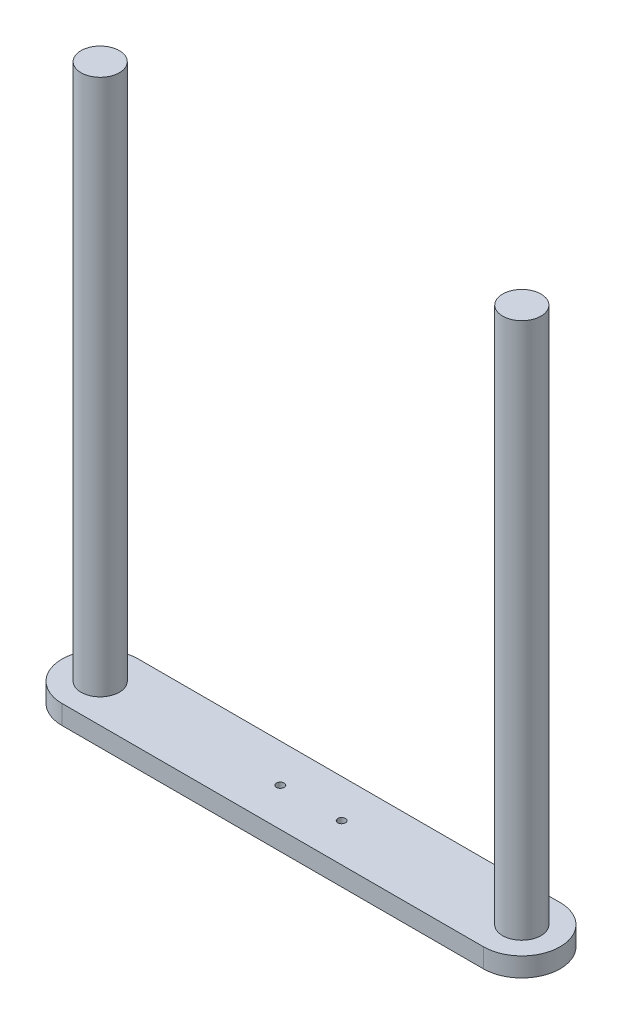
ISO-10303-21;
HEADER;
FILE_DESCRIPTION(('STEP AP214'),'2;1');
FILE_NAME('part.step','',(''),(''),'','','');
FILE_SCHEMA(('AUTOMOTIVE_DESIGN { 1 0 10303 214 1 1 1 1 }'));
ENDSEC;
DATA;
#1=APPLICATION_CONTEXT('core data for automotive mechanical design processes');
#2=APPLICATION_PROTOCOL_DEFINITION('international standard','automotive_design',2000,#1);
#3=PRODUCT_CONTEXT('',#1,'mechanical');
#4=PRODUCT('Part','Part','',(#3));
#5=PRODUCT_RELATED_PRODUCT_CATEGORY('part','',(#4));
#6=PRODUCT_DEFINITION_FORMATION('','',#4);
#7=PRODUCT_DEFINITION_CONTEXT('part definition',#1,'design');
#8=PRODUCT_DEFINITION('design','',#6,#7);
#9=PRODUCT_DEFINITION_SHAPE('','',#8);
#10=(LENGTH_UNIT() NAMED_UNIT(*) SI_UNIT(.MILLI.,.METRE.));
#11=(NAMED_UNIT(*) PLANE_ANGLE_UNIT() SI_UNIT($,.RADIAN.));
#12=(NAMED_UNIT(*) SI_UNIT($,.STERADIAN.) SOLID_ANGLE_UNIT());
#13=UNCERTAINTY_MEASURE_WITH_UNIT(LENGTH_MEASURE(1.E-05),#10,'distance_accuracy_value','');
#14=(GEOMETRIC_REPRESENTATION_CONTEXT(3) GLOBAL_UNCERTAINTY_ASSIGNED_CONTEXT((#13)) GLOBAL_UNIT_ASSIGNED_CONTEXT((#10,
#11,#12)) REPRESENTATION_CONTEXT('',''));
#15=CARTESIAN_POINT('',(0.,0.,0.));
#16=DIRECTION('',(0.,0.,1.));
#17=DIRECTION('',(1.,0.,0.));
#18=AXIS2_PLACEMENT_3D('',#15,#16,#17);
#19=CARTESIAN_POINT('',(-69.85,6.35,0.));
#20=DIRECTION('',(0.,-1.,0.));
#21=DIRECTION('',(0.,0.,-1.));
#22=AXIS2_PLACEMENT_3D('',#19,#20,#21);
#23=CYLINDRICAL_SURFACE('',#22,12.7);
#24=CARTESIAN_POINT('',(-69.85,0.,0.));
#25=DIRECTION('',(0.,1.,0.));
#26=DIRECTION('',(0.,0.,1.));
#27=AXIS2_PLACEMENT_3D('',#24,#25,#26);
#28=CIRCLE('',#27,12.7);
#29=CARTESIAN_POINT('',(-69.85,0.,-12.7));
#30=VERTEX_POINT('',#29);
#31=CARTESIAN_POINT('',(-69.85,0.,12.7));
#32=VERTEX_POINT('',#31);
#33=EDGE_CURVE('E108',#30,#32,#28,.T.);
#34=ORIENTED_EDGE('',*,*,#33,.T.);
#35=DIRECTION('',(0.,-1.,0.));
#36=VECTOR('',#35,1.);
#37=CARTESIAN_POINT('',(-69.85,6.35,12.7));
#38=LINE('',#37,#36);
#39=CARTESIAN_POINT('',(-69.85,6.35,12.7));
#40=VERTEX_POINT('',#39);
#41=EDGE_CURVE('E11',#40,#32,#38,.T.);
#42=ORIENTED_EDGE('',*,*,#41,.F.);
#43=CARTESIAN_POINT('',(-69.85,6.35,0.));
#44=DIRECTION('',(0.,1.,0.));
#45=DIRECTION('',(0.,0.,1.));
#46=AXIS2_PLACEMENT_3D('',#43,#44,#45);
#47=CIRCLE('',#46,12.7);
#48=CARTESIAN_POINT('',(-69.85,6.35,-12.7));
#49=VERTEX_POINT('',#48);
#50=EDGE_CURVE('E81',#49,#40,#47,.T.);
#51=ORIENTED_EDGE('',*,*,#50,.F.);
#52=DIRECTION('',(0.,-1.,0.));
#53=VECTOR('',#52,1.);
#54=CARTESIAN_POINT('',(-69.85,6.35,-12.7));
#55=LINE('',#54,#53);
#56=EDGE_CURVE('E104',#49,#30,#55,.T.);
#57=ORIENTED_EDGE('',*,*,#56,.T.);
#58=EDGE_LOOP('',(#34,#42,#51,#57));
#59=FACE_BOUND('',#58,.T.);
#60=ADVANCED_FACE('F41',(#59),#23,.T.);
#61=CARTESIAN_POINT('',(0.,6.35,12.7));
#62=DIRECTION('',(0.,0.,1.));
#63=DIRECTION('',(1.,0.,0.));
#64=AXIS2_PLACEMENT_3D('',#61,#62,#63);
#65=PLANE('',#64);
#66=DIRECTION('',(-1.,0.,0.));
#67=VECTOR('',#66,1.);
#68=CARTESIAN_POINT('',(0.,0.,12.7));
#69=LINE('',#68,#67);
#70=CARTESIAN_POINT('',(69.85,0.,12.7));
#71=VERTEX_POINT('',#70);
#72=EDGE_CURVE('E90',#71,#32,#69,.T.);
#73=ORIENTED_EDGE('',*,*,#72,.F.);
#74=DIRECTION('',(0.,-1.,0.));
#75=VECTOR('',#74,1.);
#76=CARTESIAN_POINT('',(69.85,6.35,12.7));
#77=LINE('',#76,#75);
#78=CARTESIAN_POINT('',(69.85,6.35,12.7));
#79=VERTEX_POINT('',#78);
#80=EDGE_CURVE('E50',#79,#71,#77,.T.);
#81=ORIENTED_EDGE('',*,*,#80,.F.);
#82=DIRECTION('',(-1.,0.,0.));
#83=VECTOR('',#82,1.);
#84=CARTESIAN_POINT('',(0.,6.35,12.7));
#85=LINE('',#84,#83);
#86=EDGE_CURVE('E88',#79,#40,#85,.T.);
#87=ORIENTED_EDGE('',*,*,#86,.T.);
#88=ORIENTED_EDGE('',*,*,#41,.T.);
#89=EDGE_LOOP('',(#73,#81,#87,#88));
#90=FACE_BOUND('',#89,.T.);
#91=ADVANCED_FACE('F87',(#90),#65,.T.);
#92=CARTESIAN_POINT('',(69.85,6.35,0.));
#93=DIRECTION('',(0.,-1.,0.));
#94=DIRECTION('',(0.,0.,-1.));
#95=AXIS2_PLACEMENT_3D('',#92,#93,#94);
#96=CYLINDRICAL_SURFACE('',#95,12.7);
#97=CARTESIAN_POINT('',(69.85,0.,0.));
#98=DIRECTION('',(0.,1.,0.));
#99=DIRECTION('',(0.,0.,1.));
#100=AXIS2_PLACEMENT_3D('',#97,#98,#99);
#101=CIRCLE('',#100,12.7);
#102=CARTESIAN_POINT('',(69.85,0.,-12.7));
#103=VERTEX_POINT('',#102);
#104=EDGE_CURVE('E115',#103,#71,#101,.F.);
#105=ORIENTED_EDGE('',*,*,#104,.F.);
#106=DIRECTION('',(0.,-1.,0.));
#107=VECTOR('',#106,1.);
#108=CARTESIAN_POINT('',(69.85,6.35,-12.7));
#109=LINE('',#108,#107);
#110=CARTESIAN_POINT('',(69.85,6.35,-12.7));
#111=VERTEX_POINT('',#110);
#112=EDGE_CURVE('E73',#111,#103,#109,.T.);
#113=ORIENTED_EDGE('',*,*,#112,.F.);
#114=CARTESIAN_POINT('',(69.85,6.35,0.));
#115=DIRECTION('',(0.,1.,0.));
#116=DIRECTION('',(0.,0.,1.));
#117=AXIS2_PLACEMENT_3D('',#114,#115,#116);
#118=CIRCLE('',#117,12.7);
#119=EDGE_CURVE('E97',#111,#79,#118,.F.);
#120=ORIENTED_EDGE('',*,*,#119,.T.);
#121=ORIENTED_EDGE('',*,*,#80,.T.);
#122=EDGE_LOOP('',(#105,#113,#120,#121));
#123=FACE_BOUND('',#122,.T.);
#124=ADVANCED_FACE('F100',(#123),#96,.T.);
#125=CARTESIAN_POINT('',(0.,6.35,-12.7));
#126=DIRECTION('',(0.,0.,1.));
#127=DIRECTION('',(1.,0.,0.));
#128=AXIS2_PLACEMENT_3D('',#125,#126,#127);
#129=PLANE('',#128);
#130=DIRECTION('',(-1.,0.,0.));
#131=VECTOR('',#130,1.);
#132=CARTESIAN_POINT('',(0.,0.,-12.7));
#133=LINE('',#132,#131);
#134=EDGE_CURVE('E76',#103,#30,#133,.T.);
#135=ORIENTED_EDGE('',*,*,#134,.T.);
#136=ORIENTED_EDGE('',*,*,#56,.F.);
#137=DIRECTION('',(-1.,0.,0.));
#138=VECTOR('',#137,1.);
#139=CARTESIAN_POINT('',(0.,6.35,-12.7));
#140=LINE('',#139,#138);
#141=EDGE_CURVE('E58',#111,#49,#140,.T.);
#142=ORIENTED_EDGE('',*,*,#141,.F.);
#143=ORIENTED_EDGE('',*,*,#112,.T.);
#144=EDGE_LOOP('',(#135,#136,#142,#143));
#145=FACE_BOUND('',#144,.T.);
#146=ADVANCED_FACE('F138',(#145),#129,.F.);
#147=CARTESIAN_POINT('',(0.,6.35,0.));
#148=DIRECTION('',(0.,1.,0.));
#149=DIRECTION('',(0.,0.,1.));
#150=AXIS2_PLACEMENT_3D('',#147,#148,#149);
#151=PLANE('',#150);
#152=CARTESIAN_POINT('',(-10.16,6.35,0.));
#153=DIRECTION('',(0.,1.,0.));
#154=DIRECTION('',(0.,0.,1.));
#155=AXIS2_PLACEMENT_3D('',#152,#153,#154);
#156=CIRCLE('',#155,1.27);
#157=CARTESIAN_POINT('',(-10.16,6.35,1.27));
#158=VERTEX_POINT('',#157);
#159=EDGE_CURVE('E240',#158,#158,#156,.T.);
#160=ORIENTED_EDGE('',*,*,#159,.F.);
#161=EDGE_LOOP('',(#160));
#162=FACE_BOUND('',#161,.T.);
#163=CARTESIAN_POINT('',(10.16,6.35,0.));
#164=DIRECTION('',(0.,1.,0.));
#165=DIRECTION('',(0.,0.,1.));
#166=AXIS2_PLACEMENT_3D('',#163,#164,#165);
#167=CIRCLE('',#166,1.27);
#168=CARTESIAN_POINT('',(10.16,6.35,1.27));
#169=VERTEX_POINT('',#168);
#170=EDGE_CURVE('E232',#169,#169,#167,.T.);
#171=ORIENTED_EDGE('',*,*,#170,.F.);
#172=EDGE_LOOP('',(#171));
#173=FACE_BOUND('',#172,.T.);
#174=CARTESIAN_POINT('',(69.85,6.35,0.));
#175=DIRECTION('',(0.,1.,0.));
#176=DIRECTION('',(0.,0.,1.));
#177=AXIS2_PLACEMENT_3D('',#174,#175,#176);
#178=CIRCLE('',#177,6.35);
#179=CARTESIAN_POINT('',(69.85,6.35,6.35));
#180=VERTEX_POINT('',#179);
#181=EDGE_CURVE('E223',#180,#180,#178,.T.);
#182=ORIENTED_EDGE('',*,*,#181,.F.);
#183=EDGE_LOOP('',(#182));
#184=FACE_BOUND('',#183,.T.);
#185=CARTESIAN_POINT('',(-69.85,6.35,0.));
#186=DIRECTION('',(0.,1.,0.));
#187=DIRECTION('',(0.,0.,1.));
#188=AXIS2_PLACEMENT_3D('',#185,#186,#187);
#189=CIRCLE('',#188,6.35000000000001);
#190=CARTESIAN_POINT('',(-69.85,6.35,6.35000000000001));
#191=VERTEX_POINT('',#190);
#192=EDGE_CURVE('E216',#191,#191,#189,.T.);
#193=ORIENTED_EDGE('',*,*,#192,.F.);
#194=EDGE_LOOP('',(#193));
#195=FACE_BOUND('',#194,.T.);
#196=ORIENTED_EDGE('',*,*,#50,.T.);
#197=ORIENTED_EDGE('',*,*,#86,.F.);
#198=ORIENTED_EDGE('',*,*,#119,.F.);
#199=ORIENTED_EDGE('',*,*,#141,.T.);
#200=EDGE_LOOP('',(#196,#197,#198,#199));
#201=FACE_BOUND('',#200,.T.);
#202=ADVANCED_FACE('F96',(#162,#173,#184,#195,#201),#151,.T.);
#203=CARTESIAN_POINT('',(0.,0.,0.));
#204=DIRECTION('',(0.,1.,0.));
#205=DIRECTION('',(0.,0.,1.));
#206=AXIS2_PLACEMENT_3D('',#203,#204,#205);
#207=PLANE('',#206);
#208=CARTESIAN_POINT('',(-10.16,0.,0.));
#209=DIRECTION('',(0.,1.,0.));
#210=DIRECTION('',(0.,0.,1.));
#211=AXIS2_PLACEMENT_3D('',#208,#209,#210);
#212=CIRCLE('',#211,1.27);
#213=CARTESIAN_POINT('',(-10.16,0.,1.27));
#214=VERTEX_POINT('',#213);
#215=EDGE_CURVE('E228',#214,#214,#212,.T.);
#216=ORIENTED_EDGE('',*,*,#215,.T.);
#217=EDGE_LOOP('',(#216));
#218=FACE_BOUND('',#217,.T.);
#219=CARTESIAN_POINT('',(10.16,0.,0.));
#220=DIRECTION('',(0.,1.,0.));
#221=DIRECTION('',(0.,0.,1.));
#222=AXIS2_PLACEMENT_3D('',#219,#220,#221);
#223=CIRCLE('',#222,1.27);
#224=CARTESIAN_POINT('',(10.16,0.,1.27));
#225=VERTEX_POINT('',#224);
#226=EDGE_CURVE('E236',#225,#225,#223,.T.);
#227=ORIENTED_EDGE('',*,*,#226,.T.);
#228=EDGE_LOOP('',(#227));
#229=FACE_BOUND('',#228,.T.);
#230=ORIENTED_EDGE('',*,*,#33,.F.);
#231=ORIENTED_EDGE('',*,*,#134,.F.);
#232=ORIENTED_EDGE('',*,*,#104,.T.);
#233=ORIENTED_EDGE('',*,*,#72,.T.);
#234=EDGE_LOOP('',(#230,#231,#232,#233));
#235=FACE_BOUND('',#234,.T.);
#236=ADVANCED_FACE('F126',(#218,#229,#235),#207,.F.);
#237=CARTESIAN_POINT('',(-69.85,184.15,0.));
#238=DIRECTION('',(0.,-1.,0.));
#239=DIRECTION('',(0.,0.,-1.));
#240=AXIS2_PLACEMENT_3D('',#237,#238,#239);
#241=CYLINDRICAL_SURFACE('',#240,6.35000000000001);
#242=CARTESIAN_POINT('',(-69.85,184.15,0.));
#243=DIRECTION('',(0.,1.,0.));
#244=DIRECTION('',(0.,0.,1.));
#245=AXIS2_PLACEMENT_3D('',#242,#243,#244);
#246=CIRCLE('',#245,6.35000000000001);
#247=CARTESIAN_POINT('',(-69.85,184.15,6.35000000000001));
#248=VERTEX_POINT('',#247);
#249=EDGE_CURVE('E112',#248,#248,#246,.T.);
#250=ORIENTED_EDGE('',*,*,#249,.F.);
#251=EDGE_LOOP('',(#250));
#252=FACE_BOUND('',#251,.T.);
#253=ORIENTED_EDGE('',*,*,#192,.T.);
#254=EDGE_LOOP('',(#253));
#255=FACE_BOUND('',#254,.T.);
#256=ADVANCED_FACE('F128',(#252,#255),#241,.T.);
#257=CARTESIAN_POINT('',(-69.85,184.15,0.));
#258=DIRECTION('',(0.,1.,0.));
#259=DIRECTION('',(0.,0.,1.));
#260=AXIS2_PLACEMENT_3D('',#257,#258,#259);
#261=PLANE('',#260);
#262=ORIENTED_EDGE('',*,*,#249,.T.);
#263=EDGE_LOOP('',(#262));
#264=FACE_BOUND('',#263,.T.);
#265=ADVANCED_FACE('F135',(#264),#261,.T.);
#266=CARTESIAN_POINT('',(69.85,184.15,0.));
#267=DIRECTION('',(0.,-1.,0.));
#268=DIRECTION('',(0.,0.,-1.));
#269=AXIS2_PLACEMENT_3D('',#266,#267,#268);
#270=CYLINDRICAL_SURFACE('',#269,6.35);
#271=CARTESIAN_POINT('',(69.85,184.15,0.));
#272=DIRECTION('',(0.,1.,0.));
#273=DIRECTION('',(0.,0.,1.));
#274=AXIS2_PLACEMENT_3D('',#271,#272,#273);
#275=CIRCLE('',#274,6.35);
#276=CARTESIAN_POINT('',(69.85,184.15,6.35));
#277=VERTEX_POINT('',#276);
#278=EDGE_CURVE('E220',#277,#277,#275,.T.);
#279=ORIENTED_EDGE('',*,*,#278,.F.);
#280=EDGE_LOOP('',(#279));
#281=FACE_BOUND('',#280,.T.);
#282=ORIENTED_EDGE('',*,*,#181,.T.);
#283=EDGE_LOOP('',(#282));
#284=FACE_BOUND('',#283,.T.);
#285=ADVANCED_FACE('F204',(#281,#284),#270,.T.);
#286=CARTESIAN_POINT('',(69.85,184.15,0.));
#287=DIRECTION('',(0.,1.,0.));
#288=DIRECTION('',(0.,0.,1.));
#289=AXIS2_PLACEMENT_3D('',#286,#287,#288);
#290=PLANE('',#289);
#291=ORIENTED_EDGE('',*,*,#278,.T.);
#292=EDGE_LOOP('',(#291));
#293=FACE_BOUND('',#292,.T.);
#294=ADVANCED_FACE('F169',(#293),#290,.T.);
#295=CARTESIAN_POINT('',(10.16,0.,0.));
#296=DIRECTION('',(0.,1.,0.));
#297=DIRECTION('',(0.,0.,1.));
#298=AXIS2_PLACEMENT_3D('',#295,#296,#297);
#299=CYLINDRICAL_SURFACE('',#298,1.27);
#300=ORIENTED_EDGE('',*,*,#226,.F.);
#301=EDGE_LOOP('',(#300));
#302=FACE_BOUND('',#301,.T.);
#303=ORIENTED_EDGE('',*,*,#170,.T.);
#304=EDGE_LOOP('',(#303));
#305=FACE_BOUND('',#304,.T.);
#306=ADVANCED_FACE('F181',(#302,#305),#299,.F.);
#307=CARTESIAN_POINT('',(-10.16,0.,0.));
#308=DIRECTION('',(0.,1.,0.));
#309=DIRECTION('',(0.,0.,1.));
#310=AXIS2_PLACEMENT_3D('',#307,#308,#309);
#311=CYLINDRICAL_SURFACE('',#310,1.27);
#312=ORIENTED_EDGE('',*,*,#215,.F.);
#313=EDGE_LOOP('',(#312));
#314=FACE_BOUND('',#313,.T.);
#315=ORIENTED_EDGE('',*,*,#159,.T.);
#316=EDGE_LOOP('',(#315));
#317=FACE_BOUND('',#316,.T.);
#318=ADVANCED_FACE('F186',(#314,#317),#311,.F.);
#319=CLOSED_SHELL('',(#60,#91,#124,#146,#202,#236,#256,#265,#285,#294,#306,#318));
#320=MANIFOLD_SOLID_BREP('B2',#319);
#321=ADVANCED_BREP_SHAPE_REPRESENTATION('',(#18,#320),#14);
#322=SHAPE_DEFINITION_REPRESENTATION(#9,#321);
ENDSEC;
END-ISO-10303-21;
